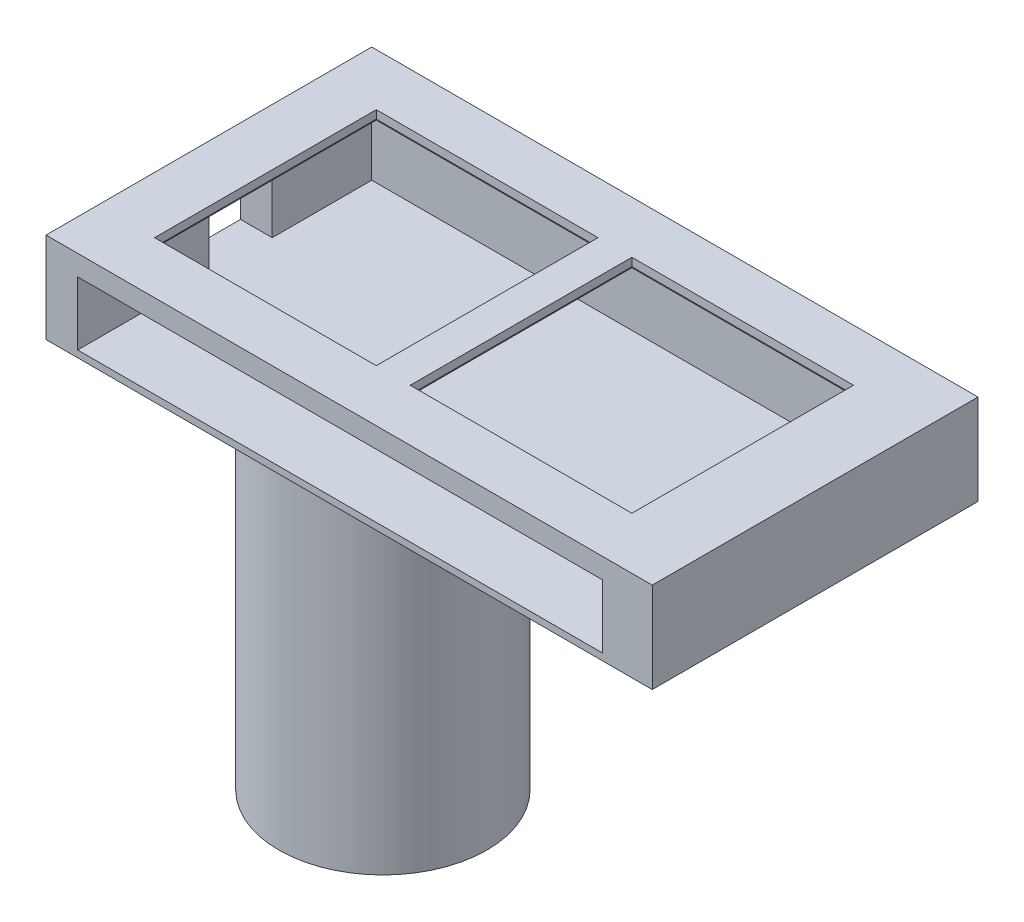
ISO-10303-21;
HEADER;
FILE_DESCRIPTION(('STEP AP214'),'2;1');
FILE_NAME('part.step','',(''),(''),'','','');
FILE_SCHEMA(('AUTOMOTIVE_DESIGN { 1 0 10303 214 1 1 1 1 }'));
ENDSEC;
DATA;
#1=APPLICATION_CONTEXT('core data for automotive mechanical design processes');
#2=APPLICATION_PROTOCOL_DEFINITION('international standard','automotive_design',2000,#1);
#3=PRODUCT_CONTEXT('',#1,'mechanical');
#4=PRODUCT('Part','Part','',(#3));
#5=PRODUCT_RELATED_PRODUCT_CATEGORY('part','',(#4));
#6=PRODUCT_DEFINITION_FORMATION('','',#4);
#7=PRODUCT_DEFINITION_CONTEXT('part definition',#1,'design');
#8=PRODUCT_DEFINITION('design','',#6,#7);
#9=PRODUCT_DEFINITION_SHAPE('','',#8);
#10=(LENGTH_UNIT() NAMED_UNIT(*) SI_UNIT(.MILLI.,.METRE.));
#11=(NAMED_UNIT(*) PLANE_ANGLE_UNIT() SI_UNIT($,.RADIAN.));
#12=(NAMED_UNIT(*) SI_UNIT($,.STERADIAN.) SOLID_ANGLE_UNIT());
#13=UNCERTAINTY_MEASURE_WITH_UNIT(LENGTH_MEASURE(1.E-05),#10,'distance_accuracy_value','');
#14=(GEOMETRIC_REPRESENTATION_CONTEXT(3) GLOBAL_UNCERTAINTY_ASSIGNED_CONTEXT((#13)) GLOBAL_UNIT_ASSIGNED_CONTEXT((#10,
#11,#12)) REPRESENTATION_CONTEXT('',''));
#15=CARTESIAN_POINT('',(0.,0.,0.));
#16=DIRECTION('',(0.,0.,1.));
#17=DIRECTION('',(1.,0.,0.));
#18=AXIS2_PLACEMENT_3D('',#15,#16,#17);
#19=CARTESIAN_POINT('',(0.,-1.80000000000001,0.));
#20=DIRECTION('',(0.,1.,0.));
#21=DIRECTION('',(-1.,0.,0.));
#22=AXIS2_PLACEMENT_3D('',#19,#20,#21);
#23=PLANE('',#22);
#24=DIRECTION('',(0.,0.,1.));
#25=VECTOR('',#24,1.);
#26=CARTESIAN_POINT('',(-70.,-1.80000000000002,-8.99999999999999));
#27=LINE('',#26,#25);
#28=CARTESIAN_POINT('',(-70.,-1.80000000000002,-63.));
#29=VERTEX_POINT('',#28);
#30=CARTESIAN_POINT('',(-70.,-1.80000000000002,-8.99999999999999));
#31=VERTEX_POINT('',#30);
#32=EDGE_CURVE('E375',#29,#31,#27,.T.);
#33=ORIENTED_EDGE('',*,*,#32,.T.);
#34=DIRECTION('',(-1.,0.,0.));
#35=VECTOR('',#34,1.);
#36=CARTESIAN_POINT('',(-70.,-1.80000000000002,-8.99999999999999));
#37=LINE('',#36,#35);
#38=CARTESIAN_POINT('',(-124.,-1.80000000000002,-9.00000000000001));
#39=VERTEX_POINT('',#38);
#40=EDGE_CURVE('E378',#31,#39,#37,.T.);
#41=ORIENTED_EDGE('',*,*,#40,.T.);
#42=DIRECTION('',(0.,0.,-1.));
#43=VECTOR('',#42,1.);
#44=CARTESIAN_POINT('',(-124.,-1.80000000000002,-9.00000000000001));
#45=LINE('',#44,#43);
#46=CARTESIAN_POINT('',(-124.,-1.80000000000002,-63.));
#47=VERTEX_POINT('',#46);
#48=EDGE_CURVE('E382',#39,#47,#45,.T.);
#49=ORIENTED_EDGE('',*,*,#48,.T.);
#50=DIRECTION('',(1.,0.,0.));
#51=VECTOR('',#50,1.);
#52=CARTESIAN_POINT('',(-70.,-1.80000000000002,-63.));
#53=LINE('',#52,#51);
#54=EDGE_CURVE('E385',#47,#29,#53,.T.);
#55=ORIENTED_EDGE('',*,*,#54,.T.);
#56=EDGE_LOOP('',(#33,#41,#49,#55));
#57=FACE_BOUND('',#56,.T.);
#58=DIRECTION('',(0.,0.,-1.));
#59=VECTOR('',#58,1.);
#60=CARTESIAN_POINT('',(-121.5,-1.80000000000002,-11.5));
#61=LINE('',#60,#59);
#62=CARTESIAN_POINT('',(-121.5,-1.80000000000002,-11.5));
#63=VERTEX_POINT('',#62);
#64=CARTESIAN_POINT('',(-121.5,-1.80000000000002,-60.5));
#65=VERTEX_POINT('',#64);
#66=EDGE_CURVE('E276',#63,#65,#61,.T.);
#67=ORIENTED_EDGE('',*,*,#66,.F.);
#68=DIRECTION('',(-1.,0.,0.));
#69=VECTOR('',#68,1.);
#70=CARTESIAN_POINT('',(-121.5,-1.80000000000002,-11.5));
#71=LINE('',#70,#69);
#72=CARTESIAN_POINT('',(-72.5,-1.80000000000002,-11.5));
#73=VERTEX_POINT('',#72);
#74=EDGE_CURVE('E311',#73,#63,#71,.T.);
#75=ORIENTED_EDGE('',*,*,#74,.F.);
#76=DIRECTION('',(0.,0.,1.));
#77=VECTOR('',#76,1.);
#78=CARTESIAN_POINT('',(-72.5,-1.80000000000002,-11.5));
#79=LINE('',#78,#77);
#80=CARTESIAN_POINT('',(-72.5,-1.80000000000002,-60.5));
#81=VERTEX_POINT('',#80);
#82=EDGE_CURVE('E315',#81,#73,#79,.T.);
#83=ORIENTED_EDGE('',*,*,#82,.F.);
#84=DIRECTION('',(1.,0.,0.));
#85=VECTOR('',#84,1.);
#86=CARTESIAN_POINT('',(-121.5,-1.80000000000002,-60.5));
#87=LINE('',#86,#85);
#88=EDGE_CURVE('E317',#65,#81,#87,.T.);
#89=ORIENTED_EDGE('',*,*,#88,.F.);
#90=EDGE_LOOP('',(#67,#75,#83,#89));
#91=FACE_BOUND('',#90,.T.);
#92=ADVANCED_FACE('F35',(#57,#91),#23,.F.);
#93=CARTESIAN_POINT('',(0.,-1.80000000000001,0.));
#94=DIRECTION('',(0.,1.,0.));
#95=DIRECTION('',(-1.,0.,0.));
#96=AXIS2_PLACEMENT_3D('',#93,#94,#95);
#97=PLANE('',#96);
#98=DIRECTION('',(0.,0.,1.));
#99=VECTOR('',#98,1.);
#100=CARTESIAN_POINT('',(-13.5,-1.80000000000001,-9.00000000000001));
#101=LINE('',#100,#99);
#102=CARTESIAN_POINT('',(-13.5,-1.80000000000001,-63.));
#103=VERTEX_POINT('',#102);
#104=CARTESIAN_POINT('',(-13.5,-1.80000000000001,-9.00000000000001));
#105=VERTEX_POINT('',#104);
#106=EDGE_CURVE('E341',#103,#105,#101,.T.);
#107=ORIENTED_EDGE('',*,*,#106,.T.);
#108=DIRECTION('',(-1.,0.,0.));
#109=VECTOR('',#108,1.);
#110=CARTESIAN_POINT('',(-13.5,-1.80000000000001,-9.00000000000001));
#111=LINE('',#110,#109);
#112=CARTESIAN_POINT('',(-67.5,-1.80000000000002,-8.99999999999999));
#113=VERTEX_POINT('',#112);
#114=EDGE_CURVE('E344',#105,#113,#111,.T.);
#115=ORIENTED_EDGE('',*,*,#114,.T.);
#116=DIRECTION('',(0.,0.,-1.));
#117=VECTOR('',#116,1.);
#118=CARTESIAN_POINT('',(-67.5,-1.80000000000002,-8.99999999999999));
#119=LINE('',#118,#117);
#120=CARTESIAN_POINT('',(-67.5,-1.80000000000002,-63.));
#121=VERTEX_POINT('',#120);
#122=EDGE_CURVE('E348',#113,#121,#119,.T.);
#123=ORIENTED_EDGE('',*,*,#122,.T.);
#124=DIRECTION('',(1.,0.,0.));
#125=VECTOR('',#124,1.);
#126=CARTESIAN_POINT('',(-13.5,-1.80000000000001,-63.));
#127=LINE('',#126,#125);
#128=EDGE_CURVE('E351',#121,#103,#127,.T.);
#129=ORIENTED_EDGE('',*,*,#128,.T.);
#130=EDGE_LOOP('',(#107,#115,#123,#129));
#131=FACE_BOUND('',#130,.T.);
#132=DIRECTION('',(0.,0.,1.));
#133=VECTOR('',#132,1.);
#134=CARTESIAN_POINT('',(-16.,-1.80000000000001,-11.5));
#135=LINE('',#134,#133);
#136=CARTESIAN_POINT('',(-16.,-1.80000000000001,-60.5));
#137=VERTEX_POINT('',#136);
#138=CARTESIAN_POINT('',(-16.,-1.80000000000001,-11.5));
#139=VERTEX_POINT('',#138);
#140=EDGE_CURVE('E286',#137,#139,#135,.T.);
#141=ORIENTED_EDGE('',*,*,#140,.F.);
#142=DIRECTION('',(1.,0.,0.));
#143=VECTOR('',#142,1.);
#144=CARTESIAN_POINT('',(-16.,-1.80000000000001,-60.5));
#145=LINE('',#144,#143);
#146=CARTESIAN_POINT('',(-65.,-1.80000000000001,-60.5));
#147=VERTEX_POINT('',#146);
#148=EDGE_CURVE('E277',#147,#137,#145,.T.);
#149=ORIENTED_EDGE('',*,*,#148,.F.);
#150=DIRECTION('',(0.,0.,-1.));
#151=VECTOR('',#150,1.);
#152=CARTESIAN_POINT('',(-65.,-1.80000000000001,-11.5));
#153=LINE('',#152,#151);
#154=CARTESIAN_POINT('',(-65.,-1.80000000000001,-11.5));
#155=VERTEX_POINT('',#154);
#156=EDGE_CURVE('E281',#155,#147,#153,.T.);
#157=ORIENTED_EDGE('',*,*,#156,.F.);
#158=DIRECTION('',(-1.,0.,0.));
#159=VECTOR('',#158,1.);
#160=CARTESIAN_POINT('',(-16.,-1.80000000000001,-11.5));
#161=LINE('',#160,#159);
#162=EDGE_CURVE('E283',#139,#155,#161,.T.);
#163=ORIENTED_EDGE('',*,*,#162,.F.);
#164=EDGE_LOOP('',(#141,#149,#157,#163));
#165=FACE_BOUND('',#164,.T.);
#166=ADVANCED_FACE('F535',(#131,#165),#97,.F.);
#167=CARTESIAN_POINT('',(-127.,-4.50000000000002,-65.));
#168=DIRECTION('',(-1.,0.,0.));
#169=DIRECTION('',(0.,0.,1.));
#170=AXIS2_PLACEMENT_3D('',#167,#168,#169);
#171=PLANE('',#170);
#172=DIRECTION('',(0.,0.,1.));
#173=VECTOR('',#172,1.);
#174=CARTESIAN_POINT('',(-127.,-4.50000000000002,-65.));
#175=LINE('',#174,#173);
#176=CARTESIAN_POINT('',(-127.,-4.50000000000002,-65.));
#177=VERTEX_POINT('',#176);
#178=CARTESIAN_POINT('',(-127.,-4.50000000000002,-43.));
#179=VERTEX_POINT('',#178);
#180=EDGE_CURVE('E466',#177,#179,#175,.T.);
#181=ORIENTED_EDGE('',*,*,#180,.T.);
#182=DIRECTION('',(0.,1.,0.));
#183=VECTOR('',#182,1.);
#184=CARTESIAN_POINT('',(-127.,-18.5,-43.));
#185=LINE('',#184,#183);
#186=CARTESIAN_POINT('',(-127.,-18.5,-43.));
#187=VERTEX_POINT('',#186);
#188=EDGE_CURVE('E416',#187,#179,#185,.T.);
#189=ORIENTED_EDGE('',*,*,#188,.F.);
#190=DIRECTION('',(0.,0.,1.));
#191=VECTOR('',#190,1.);
#192=CARTESIAN_POINT('',(-127.,-18.5,-65.));
#193=LINE('',#192,#191);
#194=CARTESIAN_POINT('',(-127.,-18.5,-65.));
#195=VERTEX_POINT('',#194);
#196=EDGE_CURVE('E470',#195,#187,#193,.T.);
#197=ORIENTED_EDGE('',*,*,#196,.F.);
#198=DIRECTION('',(0.,-1.,0.));
#199=VECTOR('',#198,1.);
#200=CARTESIAN_POINT('',(-127.,-4.50000000000002,-65.));
#201=LINE('',#200,#199);
#202=EDGE_CURVE('E441',#177,#195,#201,.T.);
#203=ORIENTED_EDGE('',*,*,#202,.F.);
#204=EDGE_LOOP('',(#181,#189,#197,#203));
#205=FACE_BOUND('',#204,.T.);
#206=ADVANCED_FACE('F541',(#205),#171,.F.);
#207=CARTESIAN_POINT('',(0.,-16.,0.));
#208=DIRECTION('',(0.,0.,-1.));
#209=DIRECTION('',(-1.,0.,0.));
#210=AXIS2_PLACEMENT_3D('',#207,#208,#209);
#211=PLANE('',#210);
#212=DIRECTION('',(-1.,0.,0.));
#213=VECTOR('',#212,1.);
#214=CARTESIAN_POINT('',(0.,0.,0.));
#215=LINE('',#214,#213);
#216=CARTESIAN_POINT('',(0.,0.,0.));
#217=VERTEX_POINT('',#216);
#218=CARTESIAN_POINT('',(-134.,0.,0.));
#219=VERTEX_POINT('',#218);
#220=EDGE_CURVE('E483',#217,#219,#215,.T.);
#221=ORIENTED_EDGE('',*,*,#220,.T.);
#222=DIRECTION('',(0.,1.,0.));
#223=VECTOR('',#222,1.);
#224=CARTESIAN_POINT('',(-134.,-16.,0.));
#225=LINE('',#224,#223);
#226=CARTESIAN_POINT('',(-134.,-20.,0.));
#227=VERTEX_POINT('',#226);
#228=EDGE_CURVE('E43',#227,#219,#225,.T.);
#229=ORIENTED_EDGE('',*,*,#228,.F.);
#230=DIRECTION('',(1.,0.,0.));
#231=VECTOR('',#230,1.);
#232=CARTESIAN_POINT('',(0.,-20.,0.));
#233=LINE('',#232,#231);
#234=CARTESIAN_POINT('',(0.,-20.,0.));
#235=VERTEX_POINT('',#234);
#236=EDGE_CURVE('E473',#227,#235,#233,.T.);
#237=ORIENTED_EDGE('',*,*,#236,.T.);
#238=DIRECTION('',(0.,1.,0.));
#239=VECTOR('',#238,1.);
#240=CARTESIAN_POINT('',(0.,-16.,0.));
#241=LINE('',#240,#239);
#242=EDGE_CURVE('E496',#235,#217,#241,.T.);
#243=ORIENTED_EDGE('',*,*,#242,.T.);
#244=EDGE_LOOP('',(#221,#229,#237,#243));
#245=FACE_BOUND('',#244,.T.);
#246=DIRECTION('',(-1.,0.,0.));
#247=VECTOR('',#246,1.);
#248=CARTESIAN_POINT('',(-11.,-18.5,0.));
#249=LINE('',#248,#247);
#250=CARTESIAN_POINT('',(-11.,-18.5,0.));
#251=VERTEX_POINT('',#250);
#252=CARTESIAN_POINT('',(-127.,-18.5,0.));
#253=VERTEX_POINT('',#252);
#254=EDGE_CURVE('E420',#251,#253,#249,.T.);
#255=ORIENTED_EDGE('',*,*,#254,.T.);
#256=DIRECTION('',(0.,-1.,0.));
#257=VECTOR('',#256,1.);
#258=CARTESIAN_POINT('',(-127.,-4.50000000000002,0.));
#259=LINE('',#258,#257);
#260=CARTESIAN_POINT('',(-127.,-4.50000000000002,0.));
#261=VERTEX_POINT('',#260);
#262=EDGE_CURVE('E453',#261,#253,#259,.T.);
#263=ORIENTED_EDGE('',*,*,#262,.F.);
#264=DIRECTION('',(-1.,0.,0.));
#265=VECTOR('',#264,1.);
#266=CARTESIAN_POINT('',(-11.,-4.50000000000001,0.));
#267=LINE('',#266,#265);
#268=CARTESIAN_POINT('',(-11.,-4.50000000000001,0.));
#269=VERTEX_POINT('',#268);
#270=EDGE_CURVE('E456',#269,#261,#267,.T.);
#271=ORIENTED_EDGE('',*,*,#270,.F.);
#272=DIRECTION('',(0.,-1.,0.));
#273=VECTOR('',#272,1.);
#274=CARTESIAN_POINT('',(-11.,-4.50000000000001,0.));
#275=LINE('',#274,#273);
#276=EDGE_CURVE('E442',#269,#251,#275,.T.);
#277=ORIENTED_EDGE('',*,*,#276,.T.);
#278=EDGE_LOOP('',(#255,#263,#271,#277));
#279=FACE_BOUND('',#278,.T.);
#280=ADVANCED_FACE('F37',(#245,#279),#211,.F.);
#281=CARTESIAN_POINT('',(-134.,-16.,0.));
#282=DIRECTION('',(1.,0.,0.));
#283=DIRECTION('',(0.,0.,-1.));
#284=AXIS2_PLACEMENT_3D('',#281,#282,#283);
#285=PLANE('',#284);
#286=DIRECTION('',(0.,0.,1.));
#287=VECTOR('',#286,1.);
#288=CARTESIAN_POINT('',(-134.,-18.5,-29.));
#289=LINE('',#288,#287);
#290=CARTESIAN_POINT('',(-134.,-18.5,-43.));
#291=VERTEX_POINT('',#290);
#292=CARTESIAN_POINT('',(-134.,-18.5,-29.));
#293=VERTEX_POINT('',#292);
#294=EDGE_CURVE('E422',#291,#293,#289,.T.);
#295=ORIENTED_EDGE('',*,*,#294,.F.);
#296=DIRECTION('',(0.,-1.,0.));
#297=VECTOR('',#296,1.);
#298=CARTESIAN_POINT('',(-134.,-18.5,-43.));
#299=LINE('',#298,#297);
#300=CARTESIAN_POINT('',(-134.,-4.50000000000002,-43.));
#301=VERTEX_POINT('',#300);
#302=EDGE_CURVE('E411',#301,#291,#299,.T.);
#303=ORIENTED_EDGE('',*,*,#302,.F.);
#304=DIRECTION('',(0.,0.,-1.));
#305=VECTOR('',#304,1.);
#306=CARTESIAN_POINT('',(-134.,-4.50000000000002,-29.));
#307=LINE('',#306,#305);
#308=CARTESIAN_POINT('',(-134.,-4.50000000000002,-29.));
#309=VERTEX_POINT('',#308);
#310=EDGE_CURVE('E428',#309,#301,#307,.T.);
#311=ORIENTED_EDGE('',*,*,#310,.F.);
#312=DIRECTION('',(0.,1.,0.));
#313=VECTOR('',#312,1.);
#314=CARTESIAN_POINT('',(-134.,-4.50000000000002,-29.));
#315=LINE('',#314,#313);
#316=EDGE_CURVE('E425',#293,#309,#315,.T.);
#317=ORIENTED_EDGE('',*,*,#316,.F.);
#318=EDGE_LOOP('',(#295,#303,#311,#317));
#319=FACE_BOUND('',#318,.T.);
#320=DIRECTION('',(0.,0.,-1.));
#321=VECTOR('',#320,1.);
#322=CARTESIAN_POINT('',(-134.,0.,0.));
#323=LINE('',#322,#321);
#324=CARTESIAN_POINT('',(-134.,0.,-72.));
#325=VERTEX_POINT('',#324);
#326=EDGE_CURVE('E493',#219,#325,#323,.T.);
#327=ORIENTED_EDGE('',*,*,#326,.T.);
#328=DIRECTION('',(0.,1.,0.));
#329=VECTOR('',#328,1.);
#330=CARTESIAN_POINT('',(-134.,-16.,-72.));
#331=LINE('',#330,#329);
#332=CARTESIAN_POINT('',(-134.,-20.,-72.));
#333=VERTEX_POINT('',#332);
#334=EDGE_CURVE('E499',#333,#325,#331,.T.);
#335=ORIENTED_EDGE('',*,*,#334,.F.);
#336=DIRECTION('',(0.,0.,1.));
#337=VECTOR('',#336,1.);
#338=CARTESIAN_POINT('',(-134.,-20.,-206.059688198951));
#339=LINE('',#338,#337);
#340=EDGE_CURVE('E476',#333,#227,#339,.T.);
#341=ORIENTED_EDGE('',*,*,#340,.T.);
#342=ORIENTED_EDGE('',*,*,#228,.T.);
#343=EDGE_LOOP('',(#327,#335,#341,#342));
#344=FACE_BOUND('',#343,.T.);
#345=ADVANCED_FACE('F519',(#319,#344),#285,.F.);
#346=CARTESIAN_POINT('',(0.,-16.,-72.));
#347=DIRECTION('',(0.,0.,-1.));
#348=DIRECTION('',(-1.,0.,0.));
#349=AXIS2_PLACEMENT_3D('',#346,#347,#348);
#350=PLANE('',#349);
#351=DIRECTION('',(-1.,0.,0.));
#352=VECTOR('',#351,1.);
#353=CARTESIAN_POINT('',(0.,0.,-72.));
#354=LINE('',#353,#352);
#355=CARTESIAN_POINT('',(0.,0.,-72.));
#356=VERTEX_POINT('',#355);
#357=EDGE_CURVE('E490',#356,#325,#354,.T.);
#358=ORIENTED_EDGE('',*,*,#357,.F.);
#359=DIRECTION('',(0.,1.,0.));
#360=VECTOR('',#359,1.);
#361=CARTESIAN_POINT('',(0.,-16.,-72.));
#362=LINE('',#361,#360);
#363=CARTESIAN_POINT('',(0.,-20.,-72.));
#364=VERTEX_POINT('',#363);
#365=EDGE_CURVE('E501',#364,#356,#362,.T.);
#366=ORIENTED_EDGE('',*,*,#365,.F.);
#367=DIRECTION('',(1.,0.,0.));
#368=VECTOR('',#367,1.);
#369=CARTESIAN_POINT('',(0.,-20.,-72.));
#370=LINE('',#369,#368);
#371=EDGE_CURVE('E477',#333,#364,#370,.T.);
#372=ORIENTED_EDGE('',*,*,#371,.F.);
#373=ORIENTED_EDGE('',*,*,#334,.T.);
#374=EDGE_LOOP('',(#358,#366,#372,#373));
#375=FACE_BOUND('',#374,.T.);
#376=ADVANCED_FACE('F516',(#375),#350,.T.);
#377=CARTESIAN_POINT('',(0.,-16.,0.));
#378=DIRECTION('',(1.,0.,0.));
#379=DIRECTION('',(0.,0.,-1.));
#380=AXIS2_PLACEMENT_3D('',#377,#378,#379);
#381=PLANE('',#380);
#382=DIRECTION('',(0.,0.,-1.));
#383=VECTOR('',#382,1.);
#384=CARTESIAN_POINT('',(0.,0.,0.));
#385=LINE('',#384,#383);
#386=EDGE_CURVE('E487',#217,#356,#385,.T.);
#387=ORIENTED_EDGE('',*,*,#386,.F.);
#388=ORIENTED_EDGE('',*,*,#242,.F.);
#389=DIRECTION('',(0.,0.,1.));
#390=VECTOR('',#389,1.);
#391=CARTESIAN_POINT('',(0.,-20.,-206.059688198951));
#392=LINE('',#391,#390);
#393=EDGE_CURVE('E480',#364,#235,#392,.T.);
#394=ORIENTED_EDGE('',*,*,#393,.F.);
#395=ORIENTED_EDGE('',*,*,#365,.T.);
#396=EDGE_LOOP('',(#387,#388,#394,#395));
#397=FACE_BOUND('',#396,.T.);
#398=ADVANCED_FACE('F512',(#397),#381,.T.);
#399=CARTESIAN_POINT('',(0.,0.,0.));
#400=DIRECTION('',(0.,1.,0.));
#401=DIRECTION('',(0.,0.,1.));
#402=AXIS2_PLACEMENT_3D('',#399,#400,#401);
#403=PLANE('',#402);
#404=DIRECTION('',(-1.,0.,0.));
#405=VECTOR('',#404,1.);
#406=CARTESIAN_POINT('',(-16.,0.,-11.5));
#407=LINE('',#406,#405);
#408=CARTESIAN_POINT('',(-16.,0.,-11.5));
#409=VERTEX_POINT('',#408);
#410=CARTESIAN_POINT('',(-65.,0.,-11.5));
#411=VERTEX_POINT('',#410);
#412=EDGE_CURVE('E280',#409,#411,#407,.T.);
#413=ORIENTED_EDGE('',*,*,#412,.T.);
#414=DIRECTION('',(0.,0.,-1.));
#415=VECTOR('',#414,1.);
#416=CARTESIAN_POINT('',(-65.,0.,-11.5));
#417=LINE('',#416,#415);
#418=CARTESIAN_POINT('',(-65.,0.,-60.5));
#419=VERTEX_POINT('',#418);
#420=EDGE_CURVE('E302',#411,#419,#417,.T.);
#421=ORIENTED_EDGE('',*,*,#420,.T.);
#422=DIRECTION('',(1.,0.,0.));
#423=VECTOR('',#422,1.);
#424=CARTESIAN_POINT('',(-16.,0.,-60.5));
#425=LINE('',#424,#423);
#426=CARTESIAN_POINT('',(-16.,0.,-60.5));
#427=VERTEX_POINT('',#426);
#428=EDGE_CURVE('E298',#419,#427,#425,.T.);
#429=ORIENTED_EDGE('',*,*,#428,.T.);
#430=DIRECTION('',(0.,0.,1.));
#431=VECTOR('',#430,1.);
#432=CARTESIAN_POINT('',(-16.,0.,-11.5));
#433=LINE('',#432,#431);
#434=EDGE_CURVE('E293',#427,#409,#433,.T.);
#435=ORIENTED_EDGE('',*,*,#434,.T.);
#436=EDGE_LOOP('',(#413,#421,#429,#435));
#437=FACE_BOUND('',#436,.T.);
#438=DIRECTION('',(1.,0.,0.));
#439=VECTOR('',#438,1.);
#440=CARTESIAN_POINT('',(-121.5,0.,-60.5));
#441=LINE('',#440,#439);
#442=CARTESIAN_POINT('',(-121.5,0.,-60.5));
#443=VERTEX_POINT('',#442);
#444=CARTESIAN_POINT('',(-72.5,0.,-60.5));
#445=VERTEX_POINT('',#444);
#446=EDGE_CURVE('E314',#443,#445,#441,.T.);
#447=ORIENTED_EDGE('',*,*,#446,.T.);
#448=DIRECTION('',(0.,0.,1.));
#449=VECTOR('',#448,1.);
#450=CARTESIAN_POINT('',(-72.5,0.,-11.5));
#451=LINE('',#450,#449);
#452=CARTESIAN_POINT('',(-72.5,0.,-11.5));
#453=VERTEX_POINT('',#452);
#454=EDGE_CURVE('E333',#445,#453,#451,.T.);
#455=ORIENTED_EDGE('',*,*,#454,.T.);
#456=DIRECTION('',(-1.,0.,0.));
#457=VECTOR('',#456,1.);
#458=CARTESIAN_POINT('',(-121.5,0.,-11.5));
#459=LINE('',#458,#457);
#460=CARTESIAN_POINT('',(-121.5,0.,-11.5));
#461=VERTEX_POINT('',#460);
#462=EDGE_CURVE('E329',#453,#461,#459,.T.);
#463=ORIENTED_EDGE('',*,*,#462,.T.);
#464=DIRECTION('',(0.,0.,-1.));
#465=VECTOR('',#464,1.);
#466=CARTESIAN_POINT('',(-121.5,0.,-11.5));
#467=LINE('',#466,#465);
#468=EDGE_CURVE('E325',#461,#443,#467,.T.);
#469=ORIENTED_EDGE('',*,*,#468,.T.);
#470=EDGE_LOOP('',(#447,#455,#463,#469));
#471=FACE_BOUND('',#470,.T.);
#472=ORIENTED_EDGE('',*,*,#220,.F.);
#473=ORIENTED_EDGE('',*,*,#386,.T.);
#474=ORIENTED_EDGE('',*,*,#357,.T.);
#475=ORIENTED_EDGE('',*,*,#326,.F.);
#476=EDGE_LOOP('',(#472,#473,#474,#475));
#477=FACE_BOUND('',#476,.T.);
#478=ADVANCED_FACE('F511',(#437,#471,#477),#403,.T.);
#479=CARTESIAN_POINT('',(0.,-20.,-206.059688198951));
#480=DIRECTION('',(0.,-1.,0.));
#481=DIRECTION('',(1.,0.,0.));
#482=AXIS2_PLACEMENT_3D('',#479,#480,#481);
#483=PLANE('',#482);
#484=ORIENTED_EDGE('',*,*,#236,.F.);
#485=ORIENTED_EDGE('',*,*,#340,.F.);
#486=ORIENTED_EDGE('',*,*,#371,.T.);
#487=ORIENTED_EDGE('',*,*,#393,.T.);
#488=EDGE_LOOP('',(#484,#485,#486,#487));
#489=FACE_BOUND('',#488,.T.);
#490=DIRECTION('',(-1.,0.,0.));
#491=VECTOR('',#490,1.);
#492=CARTESIAN_POINT('',(0.001000000000001,-20.,-23.5));
#493=LINE('',#492,#491);
#494=CARTESIAN_POINT('',(-111.149294998602,-20.,-23.5));
#495=VERTEX_POINT('',#494);
#496=CARTESIAN_POINT('',(-114.843534578913,-20.,-23.5));
#497=VERTEX_POINT('',#496);
#498=EDGE_CURVE('E50',#495,#497,#493,.T.);
#499=ORIENTED_EDGE('',*,*,#498,.T.);
#500=CARTESIAN_POINT('',(-95.5368000026056,-20.,-36.));
#501=DIRECTION('',(0.,-1.,0.));
#502=DIRECTION('',(1.,0.,0.));
#503=AXIS2_PLACEMENT_3D('',#500,#501,#502);
#504=CIRCLE('',#503,23.);
#505=CARTESIAN_POINT('',(-114.843534578913,-20.,-48.5));
#506=VERTEX_POINT('',#505);
#507=EDGE_CURVE('E407',#506,#497,#504,.T.);
#508=ORIENTED_EDGE('',*,*,#507,.F.);
#509=DIRECTION('',(-1.,0.,0.));
#510=VECTOR('',#509,1.);
#511=CARTESIAN_POINT('',(0.001000000000001,-20.,-48.5));
#512=LINE('',#511,#510);
#513=CARTESIAN_POINT('',(-111.149294998602,-20.,-48.5));
#514=VERTEX_POINT('',#513);
#515=EDGE_CURVE('E55',#514,#506,#512,.T.);
#516=ORIENTED_EDGE('',*,*,#515,.F.);
#517=CARTESIAN_POINT('',(-95.5368000026056,-20.,-36.));
#518=DIRECTION('',(0.,-1.,0.));
#519=DIRECTION('',(1.,0.,0.));
#520=AXIS2_PLACEMENT_3D('',#517,#518,#519);
#521=CIRCLE('',#520,20.);
#522=EDGE_CURVE('E11',#495,#514,#521,.F.);
#523=ORIENTED_EDGE('',*,*,#522,.F.);
#524=EDGE_LOOP('',(#499,#508,#516,#523));
#525=FACE_BOUND('',#524,.T.);
#526=ADVANCED_FACE('F521',(#489,#525),#483,.T.);
#527=CARTESIAN_POINT('',(-11.,-18.5,-65.));
#528=DIRECTION('',(0.,1.,0.));
#529=DIRECTION('',(-1.,0.,0.));
#530=AXIS2_PLACEMENT_3D('',#527,#528,#529);
#531=PLANE('',#530);
#532=ORIENTED_EDGE('',*,*,#254,.F.);
#533=DIRECTION('',(0.,0.,1.));
#534=VECTOR('',#533,1.);
#535=CARTESIAN_POINT('',(-11.,-18.5,-65.));
#536=LINE('',#535,#534);
#537=CARTESIAN_POINT('',(-11.,-18.5,-65.));
#538=VERTEX_POINT('',#537);
#539=EDGE_CURVE('E450',#538,#251,#536,.T.);
#540=ORIENTED_EDGE('',*,*,#539,.F.);
#541=DIRECTION('',(-1.,0.,0.));
#542=VECTOR('',#541,1.);
#543=CARTESIAN_POINT('',(-11.,-18.5,-65.));
#544=LINE('',#543,#542);
#545=EDGE_CURVE('E439',#538,#195,#544,.T.);
#546=ORIENTED_EDGE('',*,*,#545,.T.);
#547=ORIENTED_EDGE('',*,*,#196,.T.);
#548=DIRECTION('',(-1.,0.,0.));
#549=VECTOR('',#548,1.);
#550=CARTESIAN_POINT('',(-107.201010126777,-18.5,-43.));
#551=LINE('',#550,#549);
#552=EDGE_CURVE('E431',#187,#291,#551,.T.);
#553=ORIENTED_EDGE('',*,*,#552,.T.);
#554=ORIENTED_EDGE('',*,*,#294,.T.);
#555=DIRECTION('',(-1.,0.,0.));
#556=VECTOR('',#555,1.);
#557=CARTESIAN_POINT('',(-107.201010126777,-18.5,-29.));
#558=LINE('',#557,#556);
#559=CARTESIAN_POINT('',(-127.,-18.5,-29.));
#560=VERTEX_POINT('',#559);
#561=EDGE_CURVE('E435',#560,#293,#558,.T.);
#562=ORIENTED_EDGE('',*,*,#561,.F.);
#563=EDGE_CURVE('E469',#560,#253,#193,.T.);
#564=ORIENTED_EDGE('',*,*,#563,.T.);
#565=EDGE_LOOP('',(#532,#540,#546,#547,#553,#554,#562,#564));
#566=FACE_BOUND('',#565,.T.);
#567=ADVANCED_FACE('F523',(#566),#531,.T.);
#568=ORIENTED_EDGE('',*,*,#563,.F.);
#569=DIRECTION('',(0.,-1.,0.));
#570=VECTOR('',#569,1.);
#571=CARTESIAN_POINT('',(-127.,-4.50000000000002,-29.));
#572=LINE('',#571,#570);
#573=CARTESIAN_POINT('',(-127.,-4.50000000000002,-29.));
#574=VERTEX_POINT('',#573);
#575=EDGE_CURVE('E414',#574,#560,#572,.T.);
#576=ORIENTED_EDGE('',*,*,#575,.F.);
#577=EDGE_CURVE('E465',#574,#261,#175,.T.);
#578=ORIENTED_EDGE('',*,*,#577,.T.);
#579=ORIENTED_EDGE('',*,*,#262,.T.);
#580=EDGE_LOOP('',(#568,#576,#578,#579));
#581=FACE_BOUND('',#580,.T.);
#582=ADVANCED_FACE('F529',(#581),#171,.F.);
#583=CARTESIAN_POINT('',(-11.,-4.50000000000001,-65.));
#584=DIRECTION('',(0.,1.,0.));
#585=DIRECTION('',(-1.,0.,0.));
#586=AXIS2_PLACEMENT_3D('',#583,#584,#585);
#587=PLANE('',#586);
#588=DIRECTION('',(-1.,0.,0.));
#589=VECTOR('',#588,1.);
#590=CARTESIAN_POINT('',(-13.5,-4.50000000000001,-9.00000000000001));
#591=LINE('',#590,#589);
#592=CARTESIAN_POINT('',(-13.5,-4.50000000000001,-9.00000000000001));
#593=VERTEX_POINT('',#592);
#594=CARTESIAN_POINT('',(-67.5,-4.50000000000002,-8.99999999999999));
#595=VERTEX_POINT('',#594);
#596=EDGE_CURVE('E357',#593,#595,#591,.T.);
#597=ORIENTED_EDGE('',*,*,#596,.F.);
#598=DIRECTION('',(0.,0.,1.));
#599=VECTOR('',#598,1.);
#600=CARTESIAN_POINT('',(-13.5,-4.50000000000001,-9.00000000000001));
#601=LINE('',#600,#599);
#602=CARTESIAN_POINT('',(-13.5,-4.50000000000001,-63.));
#603=VERTEX_POINT('',#602);
#604=EDGE_CURVE('E355',#603,#593,#601,.T.);
#605=ORIENTED_EDGE('',*,*,#604,.F.);
#606=DIRECTION('',(1.,0.,0.));
#607=VECTOR('',#606,1.);
#608=CARTESIAN_POINT('',(-13.5,-4.50000000000001,-63.));
#609=LINE('',#608,#607);
#610=CARTESIAN_POINT('',(-67.5,-4.50000000000002,-63.));
#611=VERTEX_POINT('',#610);
#612=EDGE_CURVE('E345',#611,#603,#609,.T.);
#613=ORIENTED_EDGE('',*,*,#612,.F.);
#614=DIRECTION('',(0.,0.,-1.));
#615=VECTOR('',#614,1.);
#616=CARTESIAN_POINT('',(-67.5,-4.50000000000002,-8.99999999999999));
#617=LINE('',#616,#615);
#618=EDGE_CURVE('E361',#595,#611,#617,.T.);
#619=ORIENTED_EDGE('',*,*,#618,.F.);
#620=EDGE_LOOP('',(#597,#605,#613,#619));
#621=FACE_BOUND('',#620,.T.);
#622=DIRECTION('',(-1.,0.,0.));
#623=VECTOR('',#622,1.);
#624=CARTESIAN_POINT('',(-70.,-4.50000000000002,-8.99999999999999));
#625=LINE('',#624,#623);
#626=CARTESIAN_POINT('',(-70.,-4.50000000000002,-9.));
#627=VERTEX_POINT('',#626);
#628=CARTESIAN_POINT('',(-124.,-4.50000000000002,-9.00000000000001));
#629=VERTEX_POINT('',#628);
#630=EDGE_CURVE('E390',#627,#629,#625,.T.);
#631=ORIENTED_EDGE('',*,*,#630,.F.);
#632=DIRECTION('',(0.,0.,1.));
#633=VECTOR('',#632,1.);
#634=CARTESIAN_POINT('',(-70.,-4.50000000000002,-8.99999999999999));
#635=LINE('',#634,#633);
#636=CARTESIAN_POINT('',(-70.,-4.50000000000002,-63.));
#637=VERTEX_POINT('',#636);
#638=EDGE_CURVE('E310',#637,#627,#635,.T.);
#639=ORIENTED_EDGE('',*,*,#638,.F.);
#640=DIRECTION('',(1.,0.,0.));
#641=VECTOR('',#640,1.);
#642=CARTESIAN_POINT('',(-70.,-4.50000000000002,-63.));
#643=LINE('',#642,#641);
#644=CARTESIAN_POINT('',(-124.,-4.50000000000002,-63.));
#645=VERTEX_POINT('',#644);
#646=EDGE_CURVE('E379',#645,#637,#643,.T.);
#647=ORIENTED_EDGE('',*,*,#646,.F.);
#648=DIRECTION('',(0.,0.,-1.));
#649=VECTOR('',#648,1.);
#650=CARTESIAN_POINT('',(-124.,-4.50000000000002,-9.00000000000001));
#651=LINE('',#650,#649);
#652=EDGE_CURVE('E393',#629,#645,#651,.T.);
#653=ORIENTED_EDGE('',*,*,#652,.F.);
#654=EDGE_LOOP('',(#631,#639,#647,#653));
#655=FACE_BOUND('',#654,.T.);
#656=ORIENTED_EDGE('',*,*,#270,.T.);
#657=ORIENTED_EDGE('',*,*,#577,.F.);
#658=DIRECTION('',(-1.,0.,0.));
#659=VECTOR('',#658,1.);
#660=CARTESIAN_POINT('',(-107.201010126777,-4.50000000000002,-29.));
#661=LINE('',#660,#659);
#662=EDGE_CURVE('E433',#574,#309,#661,.T.);
#663=ORIENTED_EDGE('',*,*,#662,.T.);
#664=ORIENTED_EDGE('',*,*,#310,.T.);
#665=DIRECTION('',(-1.,0.,0.));
#666=VECTOR('',#665,1.);
#667=CARTESIAN_POINT('',(-107.201010126777,-4.50000000000002,-43.));
#668=LINE('',#667,#666);
#669=EDGE_CURVE('E417',#179,#301,#668,.T.);
#670=ORIENTED_EDGE('',*,*,#669,.F.);
#671=ORIENTED_EDGE('',*,*,#180,.F.);
#672=DIRECTION('',(-1.,0.,0.));
#673=VECTOR('',#672,1.);
#674=CARTESIAN_POINT('',(-11.,-4.50000000000001,-65.));
#675=LINE('',#674,#673);
#676=CARTESIAN_POINT('',(-11.,-4.50000000000001,-65.));
#677=VERTEX_POINT('',#676);
#678=EDGE_CURVE('E445',#677,#177,#675,.T.);
#679=ORIENTED_EDGE('',*,*,#678,.F.);
#680=DIRECTION('',(0.,0.,1.));
#681=VECTOR('',#680,1.);
#682=CARTESIAN_POINT('',(-11.,-4.50000000000001,-65.));
#683=LINE('',#682,#681);
#684=EDGE_CURVE('E463',#677,#269,#683,.T.);
#685=ORIENTED_EDGE('',*,*,#684,.T.);
#686=EDGE_LOOP('',(#656,#657,#663,#664,#670,#671,#679,#685));
#687=FACE_BOUND('',#686,.T.);
#688=ADVANCED_FACE('F590',(#621,#655,#687),#587,.F.);
#689=CARTESIAN_POINT('',(-11.,-4.50000000000001,-65.));
#690=DIRECTION('',(-1.,0.,0.));
#691=DIRECTION('',(0.,0.,1.));
#692=AXIS2_PLACEMENT_3D('',#689,#690,#691);
#693=PLANE('',#692);
#694=ORIENTED_EDGE('',*,*,#276,.F.);
#695=ORIENTED_EDGE('',*,*,#684,.F.);
#696=DIRECTION('',(0.,-1.,0.));
#697=VECTOR('',#696,1.);
#698=CARTESIAN_POINT('',(-11.,-4.50000000000001,-65.));
#699=LINE('',#698,#697);
#700=EDGE_CURVE('E448',#677,#538,#699,.T.);
#701=ORIENTED_EDGE('',*,*,#700,.T.);
#702=ORIENTED_EDGE('',*,*,#539,.T.);
#703=EDGE_LOOP('',(#694,#695,#701,#702));
#704=FACE_BOUND('',#703,.T.);
#705=ADVANCED_FACE('F586',(#704),#693,.T.);
#706=CARTESIAN_POINT('',(0.,0.,-65.));
#707=DIRECTION('',(0.,0.,1.));
#708=DIRECTION('',(1.,0.,0.));
#709=AXIS2_PLACEMENT_3D('',#706,#707,#708);
#710=PLANE('',#709);
#711=ORIENTED_EDGE('',*,*,#545,.F.);
#712=ORIENTED_EDGE('',*,*,#700,.F.);
#713=ORIENTED_EDGE('',*,*,#678,.T.);
#714=ORIENTED_EDGE('',*,*,#202,.T.);
#715=EDGE_LOOP('',(#711,#712,#713,#714));
#716=FACE_BOUND('',#715,.T.);
#717=ADVANCED_FACE('F582',(#716),#710,.T.);
#718=CARTESIAN_POINT('',(-107.201010126777,-18.5,-43.));
#719=DIRECTION('',(0.,0.,-1.));
#720=DIRECTION('',(-1.,0.,0.));
#721=AXIS2_PLACEMENT_3D('',#718,#719,#720);
#722=PLANE('',#721);
#723=ORIENTED_EDGE('',*,*,#188,.T.);
#724=ORIENTED_EDGE('',*,*,#669,.T.);
#725=ORIENTED_EDGE('',*,*,#302,.T.);
#726=ORIENTED_EDGE('',*,*,#552,.F.);
#727=EDGE_LOOP('',(#723,#724,#725,#726));
#728=FACE_BOUND('',#727,.T.);
#729=ADVANCED_FACE('F578',(#728),#722,.F.);
#730=CARTESIAN_POINT('',(-107.201010126777,-4.50000000000002,-29.));
#731=DIRECTION('',(0.,0.,1.));
#732=DIRECTION('',(1.,0.,0.));
#733=AXIS2_PLACEMENT_3D('',#730,#731,#732);
#734=PLANE('',#733);
#735=ORIENTED_EDGE('',*,*,#575,.T.);
#736=ORIENTED_EDGE('',*,*,#561,.T.);
#737=ORIENTED_EDGE('',*,*,#316,.T.);
#738=ORIENTED_EDGE('',*,*,#662,.F.);
#739=EDGE_LOOP('',(#735,#736,#737,#738));
#740=FACE_BOUND('',#739,.T.);
#741=ADVANCED_FACE('F571',(#740),#734,.F.);
#742=CARTESIAN_POINT('',(-95.5368000026056,-105.,-36.));
#743=DIRECTION('',(0.,-1.,0.));
#744=DIRECTION('',(1.,0.,0.));
#745=AXIS2_PLACEMENT_3D('',#742,#743,#744);
#746=PLANE('',#745);
#747=CARTESIAN_POINT('',(-95.5368000026056,-105.,-36.));
#748=DIRECTION('',(0.,-1.,0.));
#749=DIRECTION('',(1.,0.,0.));
#750=AXIS2_PLACEMENT_3D('',#747,#748,#749);
#751=CIRCLE('',#750,23.);
#752=CARTESIAN_POINT('',(-72.5368000026056,-105.,-36.));
#753=VERTEX_POINT('',#752);
#754=EDGE_CURVE('E408',#753,#753,#751,.T.);
#755=ORIENTED_EDGE('',*,*,#754,.T.);
#756=EDGE_LOOP('',(#755));
#757=FACE_BOUND('',#756,.T.);
#758=CARTESIAN_POINT('',(-95.5368000026056,-105.,-36.));
#759=DIRECTION('',(0.,-1.,0.));
#760=DIRECTION('',(1.,0.,0.));
#761=AXIS2_PLACEMENT_3D('',#758,#759,#760);
#762=CIRCLE('',#761,20.);
#763=CARTESIAN_POINT('',(-75.5368000026056,-105.,-36.));
#764=VERTEX_POINT('',#763);
#765=EDGE_CURVE('E368',#764,#764,#762,.T.);
#766=ORIENTED_EDGE('',*,*,#765,.F.);
#767=EDGE_LOOP('',(#766));
#768=FACE_BOUND('',#767,.T.);
#769=ADVANCED_FACE('F568',(#757,#768),#746,.T.);
#770=CARTESIAN_POINT('',(-95.5368000026056,-105.,-36.));
#771=DIRECTION('',(0.,1.,0.));
#772=DIRECTION('',(-1.,0.,0.));
#773=AXIS2_PLACEMENT_3D('',#770,#771,#772);
#774=CYLINDRICAL_SURFACE('',#773,23.);
#775=ORIENTED_EDGE('',*,*,#754,.F.);
#776=EDGE_LOOP('',(#775));
#777=FACE_BOUND('',#776,.T.);
#778=ORIENTED_EDGE('',*,*,#507,.T.);
#779=DIRECTION('',(0.,1.,0.));
#780=VECTOR('',#779,1.);
#781=CARTESIAN_POINT('',(-114.843534578913,-105.,-23.5));
#782=LINE('',#781,#780);
#783=CARTESIAN_POINT('',(-114.843534578913,-29.,-23.5));
#784=VERTEX_POINT('',#783);
#785=EDGE_CURVE('E273',#497,#784,#782,.F.);
#786=ORIENTED_EDGE('',*,*,#785,.T.);
#787=CARTESIAN_POINT('',(-95.5368000026056,-29.,-36.));
#788=DIRECTION('',(0.,-1.,0.));
#789=DIRECTION('',(0.,0.,-1.));
#790=AXIS2_PLACEMENT_3D('',#787,#788,#789);
#791=CIRCLE('',#790,23.);
#792=CARTESIAN_POINT('',(-114.843534578913,-29.,-48.5));
#793=VERTEX_POINT('',#792);
#794=EDGE_CURVE('E257',#784,#793,#791,.T.);
#795=ORIENTED_EDGE('',*,*,#794,.T.);
#796=DIRECTION('',(0.,1.,0.));
#797=VECTOR('',#796,1.);
#798=CARTESIAN_POINT('',(-114.843534578913,-105.,-48.5));
#799=LINE('',#798,#797);
#800=EDGE_CURVE('E270',#793,#506,#799,.T.);
#801=ORIENTED_EDGE('',*,*,#800,.T.);
#802=EDGE_LOOP('',(#778,#786,#795,#801));
#803=FACE_BOUND('',#802,.T.);
#804=ADVANCED_FACE('F567',(#777,#803),#774,.T.);
#805=CARTESIAN_POINT('',(-95.5368000026056,-105.,-36.));
#806=DIRECTION('',(0.,1.,0.));
#807=DIRECTION('',(-1.,0.,0.));
#808=AXIS2_PLACEMENT_3D('',#805,#806,#807);
#809=CYLINDRICAL_SURFACE('',#808,20.);
#810=DIRECTION('',(0.,1.,0.));
#811=VECTOR('',#810,1.);
#812=CARTESIAN_POINT('',(-111.149294998602,-105.,-23.5));
#813=LINE('',#812,#811);
#814=CARTESIAN_POINT('',(-111.149294998602,-29.,-23.5));
#815=VERTEX_POINT('',#814);
#816=EDGE_CURVE('E243',#815,#495,#813,.T.);
#817=ORIENTED_EDGE('',*,*,#816,.T.);
#818=ORIENTED_EDGE('',*,*,#522,.T.);
#819=DIRECTION('',(0.,1.,0.));
#820=VECTOR('',#819,1.);
#821=CARTESIAN_POINT('',(-111.149294998602,-105.,-48.5));
#822=LINE('',#821,#820);
#823=CARTESIAN_POINT('',(-111.149294998602,-29.,-48.5));
#824=VERTEX_POINT('',#823);
#825=EDGE_CURVE('E258',#514,#824,#822,.F.);
#826=ORIENTED_EDGE('',*,*,#825,.T.);
#827=CARTESIAN_POINT('',(-95.5368000026056,-29.,-36.));
#828=DIRECTION('',(0.,-1.,0.));
#829=DIRECTION('',(0.,0.,-1.));
#830=AXIS2_PLACEMENT_3D('',#827,#828,#829);
#831=CIRCLE('',#830,20.);
#832=EDGE_CURVE('E254',#824,#815,#831,.F.);
#833=ORIENTED_EDGE('',*,*,#832,.T.);
#834=EDGE_LOOP('',(#817,#818,#826,#833));
#835=FACE_BOUND('',#834,.T.);
#836=ORIENTED_EDGE('',*,*,#765,.T.);
#837=EDGE_LOOP('',(#836));
#838=FACE_BOUND('',#837,.T.);
#839=ADVANCED_FACE('F261',(#835,#838),#809,.F.);
#840=CARTESIAN_POINT('',(-70.,-1.80000000000002,-8.99999999999999));
#841=DIRECTION('',(1.,0.,0.));
#842=DIRECTION('',(0.,1.,0.));
#843=AXIS2_PLACEMENT_3D('',#840,#841,#842);
#844=PLANE('',#843);
#845=ORIENTED_EDGE('',*,*,#638,.T.);
#846=DIRECTION('',(0.,-1.,0.));
#847=VECTOR('',#846,1.);
#848=CARTESIAN_POINT('',(-70.,-1.80000000000002,-8.99999999999999));
#849=LINE('',#848,#847);
#850=EDGE_CURVE('E388',#31,#627,#849,.T.);
#851=ORIENTED_EDGE('',*,*,#850,.F.);
#852=ORIENTED_EDGE('',*,*,#32,.F.);
#853=DIRECTION('',(0.,-1.,0.));
#854=VECTOR('',#853,1.);
#855=CARTESIAN_POINT('',(-70.,-1.80000000000002,-63.));
#856=LINE('',#855,#854);
#857=EDGE_CURVE('E358',#29,#637,#856,.T.);
#858=ORIENTED_EDGE('',*,*,#857,.T.);
#859=EDGE_LOOP('',(#845,#851,#852,#858));
#860=FACE_BOUND('',#859,.T.);
#861=ADVANCED_FACE('F553',(#860),#844,.F.);
#862=CARTESIAN_POINT('',(-70.,-1.80000000000002,-63.));
#863=DIRECTION('',(0.,0.,-1.));
#864=DIRECTION('',(-1.,0.,0.));
#865=AXIS2_PLACEMENT_3D('',#862,#863,#864);
#866=PLANE('',#865);
#867=ORIENTED_EDGE('',*,*,#646,.T.);
#868=ORIENTED_EDGE('',*,*,#857,.F.);
#869=ORIENTED_EDGE('',*,*,#54,.F.);
#870=DIRECTION('',(0.,-1.,0.));
#871=VECTOR('',#870,1.);
#872=CARTESIAN_POINT('',(-124.,-1.80000000000002,-63.));
#873=LINE('',#872,#871);
#874=EDGE_CURVE('E399',#47,#645,#873,.T.);
#875=ORIENTED_EDGE('',*,*,#874,.T.);
#876=EDGE_LOOP('',(#867,#868,#869,#875));
#877=FACE_BOUND('',#876,.T.);
#878=ADVANCED_FACE('F549',(#877),#866,.F.);
#879=CARTESIAN_POINT('',(-124.,-1.80000000000002,-9.00000000000001));
#880=DIRECTION('',(-1.,0.,0.));
#881=DIRECTION('',(0.,-1.,0.));
#882=AXIS2_PLACEMENT_3D('',#879,#880,#881);
#883=PLANE('',#882);
#884=ORIENTED_EDGE('',*,*,#652,.T.);
#885=ORIENTED_EDGE('',*,*,#874,.F.);
#886=ORIENTED_EDGE('',*,*,#48,.F.);
#887=DIRECTION('',(0.,-1.,0.));
#888=VECTOR('',#887,1.);
#889=CARTESIAN_POINT('',(-124.,-1.80000000000002,-9.00000000000001));
#890=LINE('',#889,#888);
#891=EDGE_CURVE('E401',#39,#629,#890,.T.);
#892=ORIENTED_EDGE('',*,*,#891,.T.);
#893=EDGE_LOOP('',(#884,#885,#886,#892));
#894=FACE_BOUND('',#893,.T.);
#895=ADVANCED_FACE('F552',(#894),#883,.F.);
#896=CARTESIAN_POINT('',(-70.,-1.80000000000002,-8.99999999999999));
#897=DIRECTION('',(0.,0.,1.));
#898=DIRECTION('',(1.,0.,0.));
#899=AXIS2_PLACEMENT_3D('',#896,#897,#898);
#900=PLANE('',#899);
#901=ORIENTED_EDGE('',*,*,#630,.T.);
#902=ORIENTED_EDGE('',*,*,#891,.F.);
#903=ORIENTED_EDGE('',*,*,#40,.F.);
#904=ORIENTED_EDGE('',*,*,#850,.T.);
#905=EDGE_LOOP('',(#901,#902,#903,#904));
#906=FACE_BOUND('',#905,.T.);
#907=ADVANCED_FACE('F557',(#906),#900,.F.);
#908=CARTESIAN_POINT('',(-13.5,-1.80000000000001,-9.00000000000001));
#909=DIRECTION('',(1.,0.,0.));
#910=DIRECTION('',(0.,1.,0.));
#911=AXIS2_PLACEMENT_3D('',#908,#909,#910);
#912=PLANE('',#911);
#913=ORIENTED_EDGE('',*,*,#604,.T.);
#914=DIRECTION('',(0.,-1.,0.));
#915=VECTOR('',#914,1.);
#916=CARTESIAN_POINT('',(-13.5,-1.80000000000001,-9.00000000000001));
#917=LINE('',#916,#915);
#918=EDGE_CURVE('E354',#105,#593,#917,.T.);
#919=ORIENTED_EDGE('',*,*,#918,.F.);
#920=ORIENTED_EDGE('',*,*,#106,.F.);
#921=DIRECTION('',(0.,-1.,0.));
#922=VECTOR('',#921,1.);
#923=CARTESIAN_POINT('',(-13.5,-1.80000000000001,-63.));
#924=LINE('',#923,#922);
#925=EDGE_CURVE('E366',#103,#603,#924,.T.);
#926=ORIENTED_EDGE('',*,*,#925,.T.);
#927=EDGE_LOOP('',(#913,#919,#920,#926));
#928=FACE_BOUND('',#927,.T.);
#929=ADVANCED_FACE('F547',(#928),#912,.F.);
#930=CARTESIAN_POINT('',(-13.5,-1.80000000000001,-63.));
#931=DIRECTION('',(0.,0.,-1.));
#932=DIRECTION('',(-1.,0.,0.));
#933=AXIS2_PLACEMENT_3D('',#930,#931,#932);
#934=PLANE('',#933);
#935=ORIENTED_EDGE('',*,*,#612,.T.);
#936=ORIENTED_EDGE('',*,*,#925,.F.);
#937=ORIENTED_EDGE('',*,*,#128,.F.);
#938=DIRECTION('',(0.,-1.,0.));
#939=VECTOR('',#938,1.);
#940=CARTESIAN_POINT('',(-67.5,-1.80000000000002,-63.));
#941=LINE('',#940,#939);
#942=EDGE_CURVE('E369',#121,#611,#941,.T.);
#943=ORIENTED_EDGE('',*,*,#942,.T.);
#944=EDGE_LOOP('',(#935,#936,#937,#943));
#945=FACE_BOUND('',#944,.T.);
#946=ADVANCED_FACE('F783',(#945),#934,.F.);
#947=CARTESIAN_POINT('',(-67.5,-1.80000000000002,-8.99999999999999));
#948=DIRECTION('',(-1.,0.,0.));
#949=DIRECTION('',(0.,-1.,0.));
#950=AXIS2_PLACEMENT_3D('',#947,#948,#949);
#951=PLANE('',#950);
#952=ORIENTED_EDGE('',*,*,#618,.T.);
#953=ORIENTED_EDGE('',*,*,#942,.F.);
#954=ORIENTED_EDGE('',*,*,#122,.F.);
#955=DIRECTION('',(0.,-1.,0.));
#956=VECTOR('',#955,1.);
#957=CARTESIAN_POINT('',(-67.5,-1.80000000000002,-8.99999999999999));
#958=LINE('',#957,#956);
#959=EDGE_CURVE('E371',#113,#595,#958,.T.);
#960=ORIENTED_EDGE('',*,*,#959,.T.);
#961=EDGE_LOOP('',(#952,#953,#954,#960));
#962=FACE_BOUND('',#961,.T.);
#963=ADVANCED_FACE('F786',(#962),#951,.F.);
#964=CARTESIAN_POINT('',(-13.5,-1.80000000000001,-9.00000000000001));
#965=DIRECTION('',(0.,0.,1.));
#966=DIRECTION('',(1.,0.,0.));
#967=AXIS2_PLACEMENT_3D('',#964,#965,#966);
#968=PLANE('',#967);
#969=ORIENTED_EDGE('',*,*,#596,.T.);
#970=ORIENTED_EDGE('',*,*,#959,.F.);
#971=ORIENTED_EDGE('',*,*,#114,.F.);
#972=ORIENTED_EDGE('',*,*,#918,.T.);
#973=EDGE_LOOP('',(#969,#970,#971,#972));
#974=FACE_BOUND('',#973,.T.);
#975=ADVANCED_FACE('F656',(#974),#968,.F.);
#976=CARTESIAN_POINT('',(-121.5,69.2964645562817,-60.5));
#977=DIRECTION('',(0.,0.,-1.));
#978=DIRECTION('',(-1.,0.,0.));
#979=AXIS2_PLACEMENT_3D('',#976,#977,#978);
#980=PLANE('',#979);
#981=DIRECTION('',(0.,-1.,0.));
#982=VECTOR('',#981,1.);
#983=CARTESIAN_POINT('',(-121.5,69.2964645562817,-60.5));
#984=LINE('',#983,#982);
#985=EDGE_CURVE('E289',#443,#65,#984,.T.);
#986=ORIENTED_EDGE('',*,*,#985,.T.);
#987=ORIENTED_EDGE('',*,*,#88,.T.);
#988=DIRECTION('',(0.,-1.,0.));
#989=VECTOR('',#988,1.);
#990=CARTESIAN_POINT('',(-72.5,69.2964645562817,-60.5));
#991=LINE('',#990,#989);
#992=EDGE_CURVE('E324',#445,#81,#991,.T.);
#993=ORIENTED_EDGE('',*,*,#992,.F.);
#994=ORIENTED_EDGE('',*,*,#446,.F.);
#995=EDGE_LOOP('',(#986,#987,#993,#994));
#996=FACE_BOUND('',#995,.T.);
#997=ADVANCED_FACE('F650',(#996),#980,.F.);
#998=CARTESIAN_POINT('',(-72.5,69.2964645562817,-11.5));
#999=DIRECTION('',(1.,0.,0.));
#1000=DIRECTION('',(0.,1.,0.));
#1001=AXIS2_PLACEMENT_3D('',#998,#999,#1000);
#1002=PLANE('',#1001);
#1003=ORIENTED_EDGE('',*,*,#992,.T.);
#1004=ORIENTED_EDGE('',*,*,#82,.T.);
#1005=DIRECTION('',(0.,-1.,0.));
#1006=VECTOR('',#1005,1.);
#1007=CARTESIAN_POINT('',(-72.5,69.2964645562817,-11.5));
#1008=LINE('',#1007,#1006);
#1009=EDGE_CURVE('E332',#453,#73,#1008,.T.);
#1010=ORIENTED_EDGE('',*,*,#1009,.F.);
#1011=ORIENTED_EDGE('',*,*,#454,.F.);
#1012=EDGE_LOOP('',(#1003,#1004,#1010,#1011));
#1013=FACE_BOUND('',#1012,.T.);
#1014=ADVANCED_FACE('F655',(#1013),#1002,.F.);
#1015=CARTESIAN_POINT('',(-121.5,69.2964645562817,-11.5));
#1016=DIRECTION('',(0.,0.,1.));
#1017=DIRECTION('',(1.,0.,0.));
#1018=AXIS2_PLACEMENT_3D('',#1015,#1016,#1017);
#1019=PLANE('',#1018);
#1020=ORIENTED_EDGE('',*,*,#1009,.T.);
#1021=ORIENTED_EDGE('',*,*,#74,.T.);
#1022=DIRECTION('',(0.,-1.,0.));
#1023=VECTOR('',#1022,1.);
#1024=CARTESIAN_POINT('',(-121.5,69.2964645562817,-11.5));
#1025=LINE('',#1024,#1023);
#1026=EDGE_CURVE('E328',#461,#63,#1025,.T.);
#1027=ORIENTED_EDGE('',*,*,#1026,.F.);
#1028=ORIENTED_EDGE('',*,*,#462,.F.);
#1029=EDGE_LOOP('',(#1020,#1021,#1027,#1028));
#1030=FACE_BOUND('',#1029,.T.);
#1031=ADVANCED_FACE('F668',(#1030),#1019,.F.);
#1032=CARTESIAN_POINT('',(-121.5,69.2964645562817,-11.5));
#1033=DIRECTION('',(-1.,0.,0.));
#1034=DIRECTION('',(0.,-1.,0.));
#1035=AXIS2_PLACEMENT_3D('',#1032,#1033,#1034);
#1036=PLANE('',#1035);
#1037=ORIENTED_EDGE('',*,*,#1026,.T.);
#1038=ORIENTED_EDGE('',*,*,#66,.T.);
#1039=ORIENTED_EDGE('',*,*,#985,.F.);
#1040=ORIENTED_EDGE('',*,*,#468,.F.);
#1041=EDGE_LOOP('',(#1037,#1038,#1039,#1040));
#1042=FACE_BOUND('',#1041,.T.);
#1043=ADVANCED_FACE('F678',(#1042),#1036,.F.);
#1044=CARTESIAN_POINT('',(-16.,69.2964645562817,-11.5));
#1045=DIRECTION('',(0.,0.,1.));
#1046=DIRECTION('',(1.,0.,0.));
#1047=AXIS2_PLACEMENT_3D('',#1044,#1045,#1046);
#1048=PLANE('',#1047);
#1049=DIRECTION('',(0.,-1.,0.));
#1050=VECTOR('',#1049,1.);
#1051=CARTESIAN_POINT('',(-16.,69.2964645562817,-11.5));
#1052=LINE('',#1051,#1050);
#1053=EDGE_CURVE('E296',#409,#139,#1052,.T.);
#1054=ORIENTED_EDGE('',*,*,#1053,.T.);
#1055=ORIENTED_EDGE('',*,*,#162,.T.);
#1056=DIRECTION('',(0.,-1.,0.));
#1057=VECTOR('',#1056,1.);
#1058=CARTESIAN_POINT('',(-65.,69.2964645562817,-11.5));
#1059=LINE('',#1058,#1057);
#1060=EDGE_CURVE('E292',#411,#155,#1059,.T.);
#1061=ORIENTED_EDGE('',*,*,#1060,.F.);
#1062=ORIENTED_EDGE('',*,*,#412,.F.);
#1063=EDGE_LOOP('',(#1054,#1055,#1061,#1062));
#1064=FACE_BOUND('',#1063,.T.);
#1065=ADVANCED_FACE('F688',(#1064),#1048,.F.);
#1066=CARTESIAN_POINT('',(-65.,69.2964645562817,-11.5));
#1067=DIRECTION('',(-1.,0.,0.));
#1068=DIRECTION('',(0.,-1.,0.));
#1069=AXIS2_PLACEMENT_3D('',#1066,#1067,#1068);
#1070=PLANE('',#1069);
#1071=ORIENTED_EDGE('',*,*,#1060,.T.);
#1072=ORIENTED_EDGE('',*,*,#156,.T.);
#1073=DIRECTION('',(0.,-1.,0.));
#1074=VECTOR('',#1073,1.);
#1075=CARTESIAN_POINT('',(-65.,69.2964645562817,-60.5));
#1076=LINE('',#1075,#1074);
#1077=EDGE_CURVE('E301',#419,#147,#1076,.T.);
#1078=ORIENTED_EDGE('',*,*,#1077,.F.);
#1079=ORIENTED_EDGE('',*,*,#420,.F.);
#1080=EDGE_LOOP('',(#1071,#1072,#1078,#1079));
#1081=FACE_BOUND('',#1080,.T.);
#1082=ADVANCED_FACE('F698',(#1081),#1070,.F.);
#1083=CARTESIAN_POINT('',(-16.,69.2964645562817,-60.5));
#1084=DIRECTION('',(0.,0.,-1.));
#1085=DIRECTION('',(-1.,0.,0.));
#1086=AXIS2_PLACEMENT_3D('',#1083,#1084,#1085);
#1087=PLANE('',#1086);
#1088=ORIENTED_EDGE('',*,*,#1077,.T.);
#1089=ORIENTED_EDGE('',*,*,#148,.T.);
#1090=DIRECTION('',(0.,-1.,0.));
#1091=VECTOR('',#1090,1.);
#1092=CARTESIAN_POINT('',(-16.,69.2964645562817,-60.5));
#1093=LINE('',#1092,#1091);
#1094=EDGE_CURVE('E297',#427,#137,#1093,.T.);
#1095=ORIENTED_EDGE('',*,*,#1094,.F.);
#1096=ORIENTED_EDGE('',*,*,#428,.F.);
#1097=EDGE_LOOP('',(#1088,#1089,#1095,#1096));
#1098=FACE_BOUND('',#1097,.T.);
#1099=ADVANCED_FACE('F708',(#1098),#1087,.F.);
#1100=CARTESIAN_POINT('',(-16.,69.2964645562817,-11.5));
#1101=DIRECTION('',(1.,0.,0.));
#1102=DIRECTION('',(0.,0.,-1.));
#1103=AXIS2_PLACEMENT_3D('',#1100,#1101,#1102);
#1104=PLANE('',#1103);
#1105=ORIENTED_EDGE('',*,*,#1094,.T.);
#1106=ORIENTED_EDGE('',*,*,#140,.T.);
#1107=ORIENTED_EDGE('',*,*,#1053,.F.);
#1108=ORIENTED_EDGE('',*,*,#434,.F.);
#1109=EDGE_LOOP('',(#1105,#1106,#1107,#1108));
#1110=FACE_BOUND('',#1109,.T.);
#1111=ADVANCED_FACE('F718',(#1110),#1104,.F.);
#1112=CARTESIAN_POINT('',(0.001000000000001,-29.,-23.5));
#1113=DIRECTION('',(0.,-1.,0.));
#1114=DIRECTION('',(0.,0.,-1.));
#1115=AXIS2_PLACEMENT_3D('',#1112,#1113,#1114);
#1116=PLANE('',#1115);
#1117=DIRECTION('',(-1.,0.,0.));
#1118=VECTOR('',#1117,1.);
#1119=CARTESIAN_POINT('',(0.001000000000001,-29.,-23.5));
#1120=LINE('',#1119,#1118);
#1121=EDGE_CURVE('E246',#815,#784,#1120,.T.);
#1122=ORIENTED_EDGE('',*,*,#1121,.F.);
#1123=ORIENTED_EDGE('',*,*,#832,.F.);
#1124=DIRECTION('',(-1.,0.,0.));
#1125=VECTOR('',#1124,1.);
#1126=CARTESIAN_POINT('',(0.001000000000001,-29.,-48.5));
#1127=LINE('',#1126,#1125);
#1128=EDGE_CURVE('E267',#824,#793,#1127,.T.);
#1129=ORIENTED_EDGE('',*,*,#1128,.T.);
#1130=ORIENTED_EDGE('',*,*,#794,.F.);
#1131=EDGE_LOOP('',(#1122,#1123,#1129,#1130));
#1132=FACE_BOUND('',#1131,.T.);
#1133=ADVANCED_FACE('F252',(#1132),#1116,.F.);
#1134=CARTESIAN_POINT('',(0.001000000000001,-20.,-23.5));
#1135=DIRECTION('',(0.,0.,1.));
#1136=DIRECTION('',(0.,-1.,0.));
#1137=AXIS2_PLACEMENT_3D('',#1134,#1135,#1136);
#1138=PLANE('',#1137);
#1139=ORIENTED_EDGE('',*,*,#498,.F.);
#1140=ORIENTED_EDGE('',*,*,#816,.F.);
#1141=ORIENTED_EDGE('',*,*,#1121,.T.);
#1142=ORIENTED_EDGE('',*,*,#785,.F.);
#1143=EDGE_LOOP('',(#1139,#1140,#1141,#1142));
#1144=FACE_BOUND('',#1143,.T.);
#1145=ADVANCED_FACE('F245',(#1144),#1138,.F.);
#1146=CARTESIAN_POINT('',(0.001000000000001,-20.,-48.5));
#1147=DIRECTION('',(0.,0.,-1.));
#1148=DIRECTION('',(-1.,0.,0.));
#1149=AXIS2_PLACEMENT_3D('',#1146,#1147,#1148);
#1150=PLANE('',#1149);
#1151=ORIENTED_EDGE('',*,*,#1128,.F.);
#1152=ORIENTED_EDGE('',*,*,#825,.F.);
#1153=ORIENTED_EDGE('',*,*,#515,.T.);
#1154=ORIENTED_EDGE('',*,*,#800,.F.);
#1155=EDGE_LOOP('',(#1151,#1152,#1153,#1154));
#1156=FACE_BOUND('',#1155,.T.);
#1157=ADVANCED_FACE('F769',(#1156),#1150,.F.);
#1158=CLOSED_SHELL('',(#92,#166,#206,#280,#345,#376,#398,#478,#526,#567,#582,#688,#705,#717,
#729,#741,#769,#804,#839,#861,#878,#895,#907,#929,#946,#963,#975,#997,#1014,#1031,#1043,#1065,
#1082,#1099,#1111,#1133,#1145,#1157));
#1159=MANIFOLD_SOLID_BREP('B2',#1158);
#1160=ADVANCED_BREP_SHAPE_REPRESENTATION('',(#18,#1159),#14);
#1161=SHAPE_DEFINITION_REPRESENTATION(#9,#1160);
ENDSEC;
END-ISO-10303-21;
